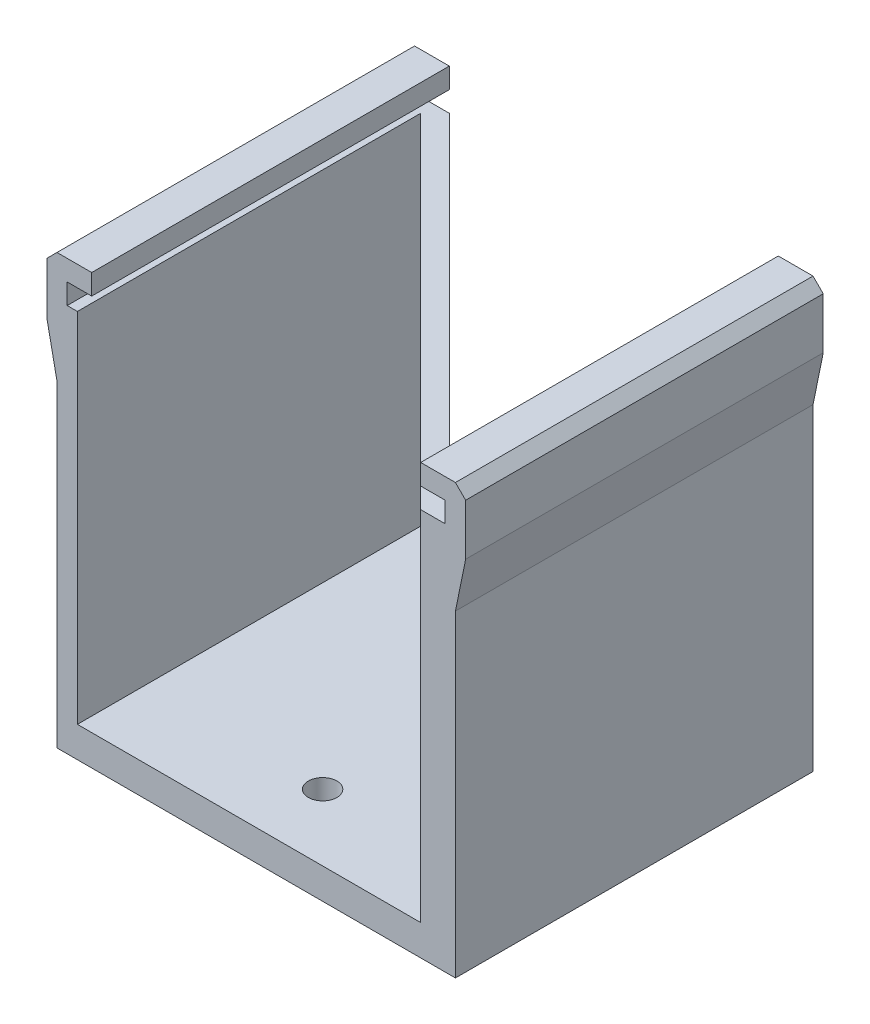
ISO-10303-21;
HEADER;
FILE_DESCRIPTION(('STEP AP214'),'2;1');
FILE_NAME('part.step','',(''),(''),'','','');
FILE_SCHEMA(('AUTOMOTIVE_DESIGN { 1 0 10303 214 1 1 1 1 }'));
ENDSEC;
DATA;
#1=APPLICATION_CONTEXT('core data for automotive mechanical design processes');
#2=APPLICATION_PROTOCOL_DEFINITION('international standard','automotive_design',2000,#1);
#3=PRODUCT_CONTEXT('',#1,'mechanical');
#4=PRODUCT('Part','Part','',(#3));
#5=PRODUCT_RELATED_PRODUCT_CATEGORY('part','',(#4));
#6=PRODUCT_DEFINITION_FORMATION('','',#4);
#7=PRODUCT_DEFINITION_CONTEXT('part definition',#1,'design');
#8=PRODUCT_DEFINITION('design','',#6,#7);
#9=PRODUCT_DEFINITION_SHAPE('','',#8);
#10=(LENGTH_UNIT() NAMED_UNIT(*) SI_UNIT(.MILLI.,.METRE.));
#11=(NAMED_UNIT(*) PLANE_ANGLE_UNIT() SI_UNIT($,.RADIAN.));
#12=(NAMED_UNIT(*) SI_UNIT($,.STERADIAN.) SOLID_ANGLE_UNIT());
#13=UNCERTAINTY_MEASURE_WITH_UNIT(LENGTH_MEASURE(1.E-05),#10,'distance_accuracy_value','');
#14=(GEOMETRIC_REPRESENTATION_CONTEXT(3) GLOBAL_UNCERTAINTY_ASSIGNED_CONTEXT((#13)) GLOBAL_UNIT_ASSIGNED_CONTEXT((#10,
#11,#12)) REPRESENTATION_CONTEXT('',''));
#15=CARTESIAN_POINT('',(0.,0.,0.));
#16=DIRECTION('',(0.,0.,1.));
#17=DIRECTION('',(1.,0.,0.));
#18=AXIS2_PLACEMENT_3D('',#15,#16,#17);
#19=CARTESIAN_POINT('',(0.,38.,0.));
#20=DIRECTION('',(0.,1.,0.));
#21=DIRECTION('',(0.,0.,1.));
#22=AXIS2_PLACEMENT_3D('',#19,#20,#21);
#23=PLANE('',#22);
#24=DIRECTION('',(1.,0.,0.));
#25=VECTOR('',#24,1.);
#26=CARTESIAN_POINT('',(-1.4,38.,0.));
#27=LINE('',#26,#25);
#28=CARTESIAN_POINT('',(-1.4,38.,0.));
#29=VERTEX_POINT('',#28);
#30=CARTESIAN_POINT('',(1.,38.,0.));
#31=VERTEX_POINT('',#30);
#32=EDGE_CURVE('E249',#29,#31,#27,.T.);
#33=ORIENTED_EDGE('',*,*,#32,.T.);
#34=DIRECTION('',(0.,0.,1.));
#35=VECTOR('',#34,1.);
#36=CARTESIAN_POINT('',(1.,38.,0.));
#37=LINE('',#36,#35);
#38=CARTESIAN_POINT('',(1.,38.,-35.));
#39=VERTEX_POINT('',#38);
#40=EDGE_CURVE('E342',#39,#31,#37,.T.);
#41=ORIENTED_EDGE('',*,*,#40,.F.);
#42=DIRECTION('',(-1.,0.,0.));
#43=VECTOR('',#42,1.);
#44=CARTESIAN_POINT('',(2.,38.,-35.));
#45=LINE('',#44,#43);
#46=CARTESIAN_POINT('',(0.,38.,-35.));
#47=VERTEX_POINT('',#46);
#48=EDGE_CURVE('E227',#39,#47,#45,.T.);
#49=ORIENTED_EDGE('',*,*,#48,.T.);
#50=DIRECTION('',(0.,0.,1.));
#51=VECTOR('',#50,1.);
#52=CARTESIAN_POINT('',(0.,38.,0.));
#53=LINE('',#52,#51);
#54=CARTESIAN_POINT('',(0.,38.,-1.42842712474617));
#55=VERTEX_POINT('',#54);
#56=EDGE_CURVE('E241',#47,#55,#53,.T.);
#57=ORIENTED_EDGE('',*,*,#56,.T.);
#58=DIRECTION('',(-0.707106781186548,0.,-0.707106781186548));
#59=VECTOR('',#58,1.);
#60=CARTESIAN_POINT('',(0.,38.,-1.42842712474617));
#61=LINE('',#60,#59);
#62=CARTESIAN_POINT('',(-33.5715728752538,38.,-35.));
#63=VERTEX_POINT('',#62);
#64=EDGE_CURVE('E254',#55,#63,#61,.T.);
#65=ORIENTED_EDGE('',*,*,#64,.T.);
#66=DIRECTION('',(-1.,0.,0.));
#67=VECTOR('',#66,1.);
#68=CARTESIAN_POINT('',(-33.5715728752538,38.,-35.));
#69=LINE('',#68,#67);
#70=CARTESIAN_POINT('',(-36.,38.,-35.));
#71=VERTEX_POINT('',#70);
#72=EDGE_CURVE('E257',#63,#71,#69,.T.);
#73=ORIENTED_EDGE('',*,*,#72,.T.);
#74=DIRECTION('',(0.,0.,-1.));
#75=VECTOR('',#74,1.);
#76=CARTESIAN_POINT('',(-36.,38.,-35.));
#77=LINE('',#76,#75);
#78=CARTESIAN_POINT('',(-36.,38.,0.));
#79=VERTEX_POINT('',#78);
#80=EDGE_CURVE('E330',#79,#71,#77,.T.);
#81=ORIENTED_EDGE('',*,*,#80,.F.);
#82=DIRECTION('',(1.,0.,0.));
#83=VECTOR('',#82,1.);
#84=CARTESIAN_POINT('',(-37.,38.,0.));
#85=LINE('',#84,#83);
#86=CARTESIAN_POINT('',(-35.,38.,0.));
#87=VERTEX_POINT('',#86);
#88=EDGE_CURVE('E242',#79,#87,#85,.T.);
#89=ORIENTED_EDGE('',*,*,#88,.T.);
#90=DIRECTION('',(0.,0.,-1.));
#91=VECTOR('',#90,1.);
#92=CARTESIAN_POINT('',(-35.,38.,-35.));
#93=LINE('',#92,#91);
#94=CARTESIAN_POINT('',(-35.,38.,-33.6));
#95=VERTEX_POINT('',#94);
#96=EDGE_CURVE('E311',#87,#95,#93,.T.);
#97=ORIENTED_EDGE('',*,*,#96,.T.);
#98=DIRECTION('',(0.707106781186547,0.,0.707106781186548));
#99=VECTOR('',#98,1.);
#100=CARTESIAN_POINT('',(-35.,38.,-33.6));
#101=LINE('',#100,#99);
#102=EDGE_CURVE('E246',#95,#29,#101,.T.);
#103=ORIENTED_EDGE('',*,*,#102,.T.);
#104=EDGE_LOOP('',(#33,#41,#49,#57,#65,#73,#81,#89,#97,#103));
#105=FACE_BOUND('',#104,.T.);
#106=ADVANCED_FACE('F39',(#105),#23,.T.);
#107=CARTESIAN_POINT('',(0.,3.,0.));
#108=DIRECTION('',(0.,1.,0.));
#109=DIRECTION('',(0.,0.,1.));
#110=AXIS2_PLACEMENT_3D('',#107,#108,#109);
#111=PLANE('',#110);
#112=CARTESIAN_POINT('',(-17.5,3.,-28.5));
#113=DIRECTION('',(0.,1.,0.));
#114=DIRECTION('',(0.,0.,1.));
#115=AXIS2_PLACEMENT_3D('',#112,#113,#114);
#116=CIRCLE('',#115,1.4);
#117=CARTESIAN_POINT('',(-17.5,3.,-27.1));
#118=VERTEX_POINT('',#117);
#119=EDGE_CURVE('E381',#118,#118,#116,.T.);
#120=ORIENTED_EDGE('',*,*,#119,.F.);
#121=EDGE_LOOP('',(#120));
#122=FACE_BOUND('',#121,.T.);
#123=DIRECTION('',(-0.707106781186548,0.,-0.707106781186548));
#124=VECTOR('',#123,1.);
#125=CARTESIAN_POINT('',(0.,3.,-1.42842712474617));
#126=LINE('',#125,#124);
#127=CARTESIAN_POINT('',(0.,3.,-1.42842712474617));
#128=VERTEX_POINT('',#127);
#129=CARTESIAN_POINT('',(-33.5715728752538,3.,-35.));
#130=VERTEX_POINT('',#129);
#131=EDGE_CURVE('E250',#128,#130,#126,.T.);
#132=ORIENTED_EDGE('',*,*,#131,.F.);
#133=DIRECTION('',(0.,0.,-1.));
#134=VECTOR('',#133,1.);
#135=CARTESIAN_POINT('',(0.,3.,0.));
#136=LINE('',#135,#134);
#137=CARTESIAN_POINT('',(0.,3.,-35.));
#138=VERTEX_POINT('',#137);
#139=EDGE_CURVE('E283',#128,#138,#136,.T.);
#140=ORIENTED_EDGE('',*,*,#139,.T.);
#141=DIRECTION('',(-1.,0.,0.));
#142=VECTOR('',#141,1.);
#143=CARTESIAN_POINT('',(0.,3.,-35.));
#144=LINE('',#143,#142);
#145=EDGE_CURVE('E287',#138,#130,#144,.T.);
#146=ORIENTED_EDGE('',*,*,#145,.T.);
#147=EDGE_LOOP('',(#132,#140,#146));
#148=FACE_BOUND('',#147,.T.);
#149=ADVANCED_FACE('F398',(#122,#148),#111,.T.);
#150=CARTESIAN_POINT('',(0.,3.,-35.));
#151=DIRECTION('',(0.,0.,1.));
#152=DIRECTION('',(1.,0.,0.));
#153=AXIS2_PLACEMENT_3D('',#150,#151,#152);
#154=PLANE('',#153);
#155=DIRECTION('',(-1.,0.,0.));
#156=VECTOR('',#155,1.);
#157=CARTESIAN_POINT('',(0.,0.,-35.));
#158=LINE('',#157,#156);
#159=CARTESIAN_POINT('',(2.,0.,-35.));
#160=VERTEX_POINT('',#159);
#161=CARTESIAN_POINT('',(-37.,0.,-35.));
#162=VERTEX_POINT('',#161);
#163=EDGE_CURVE('E282',#160,#162,#158,.T.);
#164=ORIENTED_EDGE('',*,*,#163,.T.);
#165=DIRECTION('',(0.,-1.,0.));
#166=VECTOR('',#165,1.);
#167=CARTESIAN_POINT('',(-37.,38.,-35.));
#168=LINE('',#167,#166);
#169=CARTESIAN_POINT('',(-37.,31.1010205144337,-35.));
#170=VERTEX_POINT('',#169);
#171=EDGE_CURVE('E306',#170,#162,#168,.T.);
#172=ORIENTED_EDGE('',*,*,#171,.F.);
#173=DIRECTION('',(0.2,-0.979795897113271,0.));
#174=VECTOR('',#173,1.);
#175=CARTESIAN_POINT('',(-38.,36.,-35.));
#176=LINE('',#175,#174);
#177=CARTESIAN_POINT('',(-38.,36.,-35.));
#178=VERTEX_POINT('',#177);
#179=EDGE_CURVE('E759',#178,#170,#176,.T.);
#180=ORIENTED_EDGE('',*,*,#179,.F.);
#181=DIRECTION('',(0.,-1.,0.));
#182=VECTOR('',#181,1.);
#183=CARTESIAN_POINT('',(-38.,41.,-35.));
#184=LINE('',#183,#182);
#185=CARTESIAN_POINT('',(-38.,41.,-35.));
#186=VERTEX_POINT('',#185);
#187=EDGE_CURVE('E754',#186,#178,#184,.T.);
#188=ORIENTED_EDGE('',*,*,#187,.F.);
#189=DIRECTION('',(-0.707106781186547,-0.707106781186547,0.));
#190=VECTOR('',#189,1.);
#191=CARTESIAN_POINT('',(-37.,42.,-35.));
#192=LINE('',#191,#190);
#193=CARTESIAN_POINT('',(-37.,42.,-35.));
#194=VERTEX_POINT('',#193);
#195=EDGE_CURVE('E750',#194,#186,#192,.T.);
#196=ORIENTED_EDGE('',*,*,#195,.F.);
#197=DIRECTION('',(-1.,0.,0.));
#198=VECTOR('',#197,1.);
#199=CARTESIAN_POINT('',(-37.,42.,-35.));
#200=LINE('',#199,#198);
#201=CARTESIAN_POINT('',(-33.6,42.,-35.));
#202=VERTEX_POINT('',#201);
#203=EDGE_CURVE('E819',#202,#194,#200,.T.);
#204=ORIENTED_EDGE('',*,*,#203,.F.);
#205=DIRECTION('',(0.,1.,0.));
#206=VECTOR('',#205,1.);
#207=CARTESIAN_POINT('',(-33.6,40.,-35.));
#208=LINE('',#207,#206);
#209=CARTESIAN_POINT('',(-33.6,40.,-35.));
#210=VERTEX_POINT('',#209);
#211=EDGE_CURVE('E814',#210,#202,#208,.T.);
#212=ORIENTED_EDGE('',*,*,#211,.F.);
#213=DIRECTION('',(1.,0.,0.));
#214=VECTOR('',#213,1.);
#215=CARTESIAN_POINT('',(-37.,40.,-35.));
#216=LINE('',#215,#214);
#217=CARTESIAN_POINT('',(-36.,40.,-35.));
#218=VERTEX_POINT('',#217);
#219=EDGE_CURVE('E811',#218,#210,#216,.T.);
#220=ORIENTED_EDGE('',*,*,#219,.F.);
#221=DIRECTION('',(0.,-1.,0.));
#222=VECTOR('',#221,1.);
#223=CARTESIAN_POINT('',(-36.,40.,-35.));
#224=LINE('',#223,#222);
#225=EDGE_CURVE('E367',#218,#71,#224,.T.);
#226=ORIENTED_EDGE('',*,*,#225,.T.);
#227=ORIENTED_EDGE('',*,*,#72,.F.);
#228=DIRECTION('',(0.,-1.,0.));
#229=VECTOR('',#228,1.);
#230=CARTESIAN_POINT('',(-33.5715728752538,38.,-35.));
#231=LINE('',#230,#229);
#232=EDGE_CURVE('E260',#63,#130,#231,.T.);
#233=ORIENTED_EDGE('',*,*,#232,.T.);
#234=ORIENTED_EDGE('',*,*,#145,.F.);
#235=DIRECTION('',(0.,1.,0.));
#236=VECTOR('',#235,1.);
#237=CARTESIAN_POINT('',(0.,0.,-35.));
#238=LINE('',#237,#236);
#239=EDGE_CURVE('E237',#138,#47,#238,.T.);
#240=ORIENTED_EDGE('',*,*,#239,.T.);
#241=ORIENTED_EDGE('',*,*,#48,.F.);
#242=DIRECTION('',(0.,-1.,0.));
#243=VECTOR('',#242,1.);
#244=CARTESIAN_POINT('',(1.,40.,-35.));
#245=LINE('',#244,#243);
#246=CARTESIAN_POINT('',(1.,40.,-35.));
#247=VERTEX_POINT('',#246);
#248=EDGE_CURVE('E354',#247,#39,#245,.T.);
#249=ORIENTED_EDGE('',*,*,#248,.F.);
#250=DIRECTION('',(1.,0.,0.));
#251=VECTOR('',#250,1.);
#252=CARTESIAN_POINT('',(2.,40.,-35.));
#253=LINE('',#252,#251);
#254=CARTESIAN_POINT('',(-1.4,40.,-35.));
#255=VERTEX_POINT('',#254);
#256=EDGE_CURVE('E789',#255,#247,#253,.T.);
#257=ORIENTED_EDGE('',*,*,#256,.F.);
#258=DIRECTION('',(0.,-1.,0.));
#259=VECTOR('',#258,1.);
#260=CARTESIAN_POINT('',(-1.4,40.,-35.));
#261=LINE('',#260,#259);
#262=CARTESIAN_POINT('',(-1.4,42.,-35.));
#263=VERTEX_POINT('',#262);
#264=EDGE_CURVE('E785',#263,#255,#261,.T.);
#265=ORIENTED_EDGE('',*,*,#264,.F.);
#266=DIRECTION('',(-1.,0.,0.));
#267=VECTOR('',#266,1.);
#268=CARTESIAN_POINT('',(2.,42.,-35.));
#269=LINE('',#268,#267);
#270=CARTESIAN_POINT('',(2.,42.,-35.));
#271=VERTEX_POINT('',#270);
#272=EDGE_CURVE('E781',#271,#263,#269,.T.);
#273=ORIENTED_EDGE('',*,*,#272,.F.);
#274=DIRECTION('',(-0.707106781186547,0.707106781186548,0.));
#275=VECTOR('',#274,1.);
#276=CARTESIAN_POINT('',(2.,42.,-35.));
#277=LINE('',#276,#275);
#278=CARTESIAN_POINT('',(3.,41.,-35.));
#279=VERTEX_POINT('',#278);
#280=EDGE_CURVE('E209',#279,#271,#277,.T.);
#281=ORIENTED_EDGE('',*,*,#280,.F.);
#282=DIRECTION('',(0.,1.,0.));
#283=VECTOR('',#282,1.);
#284=CARTESIAN_POINT('',(3.,41.,-35.));
#285=LINE('',#284,#283);
#286=CARTESIAN_POINT('',(3.,36.,-35.));
#287=VERTEX_POINT('',#286);
#288=EDGE_CURVE('E218',#287,#279,#285,.T.);
#289=ORIENTED_EDGE('',*,*,#288,.F.);
#290=DIRECTION('',(0.2,0.979795897113271,0.));
#291=VECTOR('',#290,1.);
#292=CARTESIAN_POINT('',(3.,36.,-35.));
#293=LINE('',#292,#291);
#294=CARTESIAN_POINT('',(2.,31.1010205144337,-35.));
#295=VERTEX_POINT('',#294);
#296=EDGE_CURVE('E203',#295,#287,#293,.T.);
#297=ORIENTED_EDGE('',*,*,#296,.F.);
#298=DIRECTION('',(0.,1.,0.));
#299=VECTOR('',#298,1.);
#300=CARTESIAN_POINT('',(2.,0.,-35.));
#301=LINE('',#300,#299);
#302=EDGE_CURVE('E215',#160,#295,#301,.T.);
#303=ORIENTED_EDGE('',*,*,#302,.F.);
#304=EDGE_LOOP('',(#164,#172,#180,#188,#196,#204,#212,#220,#226,#227,#233,#234,#240,#241,#249,
#257,#265,#273,#281,#289,#297,#303));
#305=FACE_BOUND('',#304,.T.);
#306=ADVANCED_FACE('F41',(#305),#154,.F.);
#307=CARTESIAN_POINT('',(0.,3.,0.));
#308=DIRECTION('',(0.,0.,-1.));
#309=DIRECTION('',(-1.,0.,0.));
#310=AXIS2_PLACEMENT_3D('',#307,#308,#309);
#311=PLANE('',#310);
#312=DIRECTION('',(1.,0.,0.));
#313=VECTOR('',#312,1.);
#314=CARTESIAN_POINT('',(0.,0.,0.));
#315=LINE('',#314,#313);
#316=CARTESIAN_POINT('',(-37.,0.,0.));
#317=VERTEX_POINT('',#316);
#318=CARTESIAN_POINT('',(2.,0.,0.));
#319=VERTEX_POINT('',#318);
#320=EDGE_CURVE('E43',#317,#319,#315,.T.);
#321=ORIENTED_EDGE('',*,*,#320,.T.);
#322=DIRECTION('',(0.,-1.,0.));
#323=VECTOR('',#322,1.);
#324=CARTESIAN_POINT('',(2.,0.,0.));
#325=LINE('',#324,#323);
#326=CARTESIAN_POINT('',(2.,31.1010205144337,0.));
#327=VERTEX_POINT('',#326);
#328=EDGE_CURVE('E233',#327,#319,#325,.T.);
#329=ORIENTED_EDGE('',*,*,#328,.F.);
#330=DIRECTION('',(0.2,0.979795897113271,0.));
#331=VECTOR('',#330,1.);
#332=CARTESIAN_POINT('',(3.,36.,0.));
#333=LINE('',#332,#331);
#334=CARTESIAN_POINT('',(3.,36.,0.));
#335=VERTEX_POINT('',#334);
#336=EDGE_CURVE('E57',#327,#335,#333,.T.);
#337=ORIENTED_EDGE('',*,*,#336,.T.);
#338=DIRECTION('',(0.,1.,0.));
#339=VECTOR('',#338,1.);
#340=CARTESIAN_POINT('',(3.,41.,0.));
#341=LINE('',#340,#339);
#342=CARTESIAN_POINT('',(3.,41.,0.));
#343=VERTEX_POINT('',#342);
#344=EDGE_CURVE('E732',#335,#343,#341,.T.);
#345=ORIENTED_EDGE('',*,*,#344,.T.);
#346=DIRECTION('',(-0.707106781186547,0.707106781186548,0.));
#347=VECTOR('',#346,1.);
#348=CARTESIAN_POINT('',(2.,42.,0.));
#349=LINE('',#348,#347);
#350=CARTESIAN_POINT('',(2.,42.,0.));
#351=VERTEX_POINT('',#350);
#352=EDGE_CURVE('E220',#343,#351,#349,.T.);
#353=ORIENTED_EDGE('',*,*,#352,.T.);
#354=DIRECTION('',(-1.,0.,0.));
#355=VECTOR('',#354,1.);
#356=CARTESIAN_POINT('',(2.,42.,0.));
#357=LINE('',#356,#355);
#358=CARTESIAN_POINT('',(-1.4,42.,0.));
#359=VERTEX_POINT('',#358);
#360=EDGE_CURVE('E775',#351,#359,#357,.T.);
#361=ORIENTED_EDGE('',*,*,#360,.T.);
#362=DIRECTION('',(0.,-1.,0.));
#363=VECTOR('',#362,1.);
#364=CARTESIAN_POINT('',(-1.4,40.,0.));
#365=LINE('',#364,#363);
#366=CARTESIAN_POINT('',(-1.4,40.,0.));
#367=VERTEX_POINT('',#366);
#368=EDGE_CURVE('E797',#359,#367,#365,.T.);
#369=ORIENTED_EDGE('',*,*,#368,.T.);
#370=DIRECTION('',(1.,0.,0.));
#371=VECTOR('',#370,1.);
#372=CARTESIAN_POINT('',(2.,40.,0.));
#373=LINE('',#372,#371);
#374=CARTESIAN_POINT('',(1.,40.,0.));
#375=VERTEX_POINT('',#374);
#376=EDGE_CURVE('E349',#367,#375,#373,.T.);
#377=ORIENTED_EDGE('',*,*,#376,.T.);
#378=DIRECTION('',(0.,-1.,0.));
#379=VECTOR('',#378,1.);
#380=CARTESIAN_POINT('',(1.,40.,0.));
#381=LINE('',#380,#379);
#382=EDGE_CURVE('E346',#375,#31,#381,.T.);
#383=ORIENTED_EDGE('',*,*,#382,.T.);
#384=ORIENTED_EDGE('',*,*,#32,.F.);
#385=DIRECTION('',(0.,-1.,0.));
#386=VECTOR('',#385,1.);
#387=CARTESIAN_POINT('',(-1.4,38.,0.));
#388=LINE('',#387,#386);
#389=CARTESIAN_POINT('',(-1.4,3.,0.));
#390=VERTEX_POINT('',#389);
#391=EDGE_CURVE('E274',#29,#390,#388,.T.);
#392=ORIENTED_EDGE('',*,*,#391,.T.);
#393=DIRECTION('',(1.,0.,0.));
#394=VECTOR('',#393,1.);
#395=CARTESIAN_POINT('',(0.,3.,0.));
#396=LINE('',#395,#394);
#397=CARTESIAN_POINT('',(-35.,3.,0.));
#398=VERTEX_POINT('',#397);
#399=EDGE_CURVE('E11',#398,#390,#396,.T.);
#400=ORIENTED_EDGE('',*,*,#399,.F.);
#401=DIRECTION('',(0.,1.,0.));
#402=VECTOR('',#401,1.);
#403=CARTESIAN_POINT('',(-35.,38.,0.));
#404=LINE('',#403,#402);
#405=EDGE_CURVE('E315',#398,#87,#404,.T.);
#406=ORIENTED_EDGE('',*,*,#405,.T.);
#407=ORIENTED_EDGE('',*,*,#88,.F.);
#408=DIRECTION('',(0.,-1.,0.));
#409=VECTOR('',#408,1.);
#410=CARTESIAN_POINT('',(-36.,40.,0.));
#411=LINE('',#410,#409);
#412=CARTESIAN_POINT('',(-36.,40.,0.));
#413=VERTEX_POINT('',#412);
#414=EDGE_CURVE('E373',#413,#79,#411,.T.);
#415=ORIENTED_EDGE('',*,*,#414,.F.);
#416=DIRECTION('',(1.,0.,0.));
#417=VECTOR('',#416,1.);
#418=CARTESIAN_POINT('',(-37.,40.,0.));
#419=LINE('',#418,#417);
#420=CARTESIAN_POINT('',(-33.6,40.,0.));
#421=VERTEX_POINT('',#420);
#422=EDGE_CURVE('E805',#413,#421,#419,.T.);
#423=ORIENTED_EDGE('',*,*,#422,.T.);
#424=DIRECTION('',(0.,1.,0.));
#425=VECTOR('',#424,1.);
#426=CARTESIAN_POINT('',(-33.6,40.,0.));
#427=LINE('',#426,#425);
#428=CARTESIAN_POINT('',(-33.6,42.,0.));
#429=VERTEX_POINT('',#428);
#430=EDGE_CURVE('E825',#421,#429,#427,.T.);
#431=ORIENTED_EDGE('',*,*,#430,.T.);
#432=DIRECTION('',(-1.,0.,0.));
#433=VECTOR('',#432,1.);
#434=CARTESIAN_POINT('',(-37.,42.,0.));
#435=LINE('',#434,#433);
#436=CARTESIAN_POINT('',(-37.,42.,0.));
#437=VERTEX_POINT('',#436);
#438=EDGE_CURVE('E815',#429,#437,#435,.T.);
#439=ORIENTED_EDGE('',*,*,#438,.T.);
#440=DIRECTION('',(-0.707106781186547,-0.707106781186547,0.));
#441=VECTOR('',#440,1.);
#442=CARTESIAN_POINT('',(-37.,42.,0.));
#443=LINE('',#442,#441);
#444=CARTESIAN_POINT('',(-38.,41.,0.));
#445=VERTEX_POINT('',#444);
#446=EDGE_CURVE('E747',#437,#445,#443,.T.);
#447=ORIENTED_EDGE('',*,*,#446,.T.);
#448=DIRECTION('',(0.,-1.,0.));
#449=VECTOR('',#448,1.);
#450=CARTESIAN_POINT('',(-38.,41.,0.));
#451=LINE('',#450,#449);
#452=CARTESIAN_POINT('',(-38.,36.,0.));
#453=VERTEX_POINT('',#452);
#454=EDGE_CURVE('E767',#445,#453,#451,.T.);
#455=ORIENTED_EDGE('',*,*,#454,.T.);
#456=DIRECTION('',(0.2,-0.979795897113271,0.));
#457=VECTOR('',#456,1.);
#458=CARTESIAN_POINT('',(-38.,36.,0.));
#459=LINE('',#458,#457);
#460=CARTESIAN_POINT('',(-37.,31.1010205144337,0.));
#461=VERTEX_POINT('',#460);
#462=EDGE_CURVE('E755',#453,#461,#459,.T.);
#463=ORIENTED_EDGE('',*,*,#462,.T.);
#464=DIRECTION('',(0.,1.,0.));
#465=VECTOR('',#464,1.);
#466=CARTESIAN_POINT('',(-37.,38.,0.));
#467=LINE('',#466,#465);
#468=EDGE_CURVE('E300',#317,#461,#467,.T.);
#469=ORIENTED_EDGE('',*,*,#468,.F.);
#470=EDGE_LOOP('',(#321,#329,#337,#345,#353,#361,#369,#377,#383,#384,#392,#400,#406,#407,#415,
#423,#431,#439,#447,#455,#463,#469));
#471=FACE_BOUND('',#470,.T.);
#472=ADVANCED_FACE('F298',(#471),#311,.F.);
#473=CARTESIAN_POINT('',(-17.5,3.,-6.5));
#474=DIRECTION('',(0.,1.,0.));
#475=DIRECTION('',(0.,0.,1.));
#476=AXIS2_PLACEMENT_3D('',#473,#474,#475);
#477=CIRCLE('',#476,1.4);
#478=CARTESIAN_POINT('',(-17.5,3.,-5.1));
#479=VERTEX_POINT('',#478);
#480=EDGE_CURVE('E319',#479,#479,#477,.T.);
#481=ORIENTED_EDGE('',*,*,#480,.F.);
#482=EDGE_LOOP('',(#481));
#483=FACE_BOUND('',#482,.T.);
#484=DIRECTION('',(0.707106781186547,0.,0.707106781186548));
#485=VECTOR('',#484,1.);
#486=CARTESIAN_POINT('',(-35.,3.,-33.6));
#487=LINE('',#486,#485);
#488=CARTESIAN_POINT('',(-35.,3.,-33.6));
#489=VERTEX_POINT('',#488);
#490=EDGE_CURVE('E231',#489,#390,#487,.T.);
#491=ORIENTED_EDGE('',*,*,#490,.F.);
#492=DIRECTION('',(0.,0.,1.));
#493=VECTOR('',#492,1.);
#494=CARTESIAN_POINT('',(-35.,3.,0.));
#495=LINE('',#494,#493);
#496=EDGE_CURVE('E49',#489,#398,#495,.T.);
#497=ORIENTED_EDGE('',*,*,#496,.T.);
#498=ORIENTED_EDGE('',*,*,#399,.T.);
#499=EDGE_LOOP('',(#491,#497,#498));
#500=FACE_BOUND('',#499,.T.);
#501=ADVANCED_FACE('F394',(#483,#500),#111,.T.);
#502=CARTESIAN_POINT('',(0.,0.,0.));
#503=DIRECTION('',(0.,1.,0.));
#504=DIRECTION('',(0.,0.,1.));
#505=AXIS2_PLACEMENT_3D('',#502,#503,#504);
#506=PLANE('',#505);
#507=CARTESIAN_POINT('',(-17.5,0.,-6.5));
#508=DIRECTION('',(0.,-1.,0.));
#509=DIRECTION('',(0.,0.,-1.));
#510=AXIS2_PLACEMENT_3D('',#507,#508,#509);
#511=CIRCLE('',#510,1.4);
#512=CARTESIAN_POINT('',(-17.5,0.,-7.9));
#513=VERTEX_POINT('',#512);
#514=EDGE_CURVE('E377',#513,#513,#511,.T.);
#515=ORIENTED_EDGE('',*,*,#514,.F.);
#516=EDGE_LOOP('',(#515));
#517=FACE_BOUND('',#516,.T.);
#518=CARTESIAN_POINT('',(-17.5,0.,-28.5));
#519=DIRECTION('',(0.,-1.,0.));
#520=DIRECTION('',(0.,0.,-1.));
#521=AXIS2_PLACEMENT_3D('',#518,#519,#520);
#522=CIRCLE('',#521,1.4);
#523=CARTESIAN_POINT('',(-17.5,0.,-29.9));
#524=VERTEX_POINT('',#523);
#525=EDGE_CURVE('E376',#524,#524,#522,.T.);
#526=ORIENTED_EDGE('',*,*,#525,.F.);
#527=EDGE_LOOP('',(#526));
#528=FACE_BOUND('',#527,.T.);
#529=ORIENTED_EDGE('',*,*,#163,.F.);
#530=DIRECTION('',(0.,0.,-1.));
#531=VECTOR('',#530,1.);
#532=CARTESIAN_POINT('',(2.,0.,0.));
#533=LINE('',#532,#531);
#534=EDGE_CURVE('E225',#319,#160,#533,.T.);
#535=ORIENTED_EDGE('',*,*,#534,.F.);
#536=ORIENTED_EDGE('',*,*,#320,.F.);
#537=DIRECTION('',(0.,0.,1.));
#538=VECTOR('',#537,1.);
#539=CARTESIAN_POINT('',(-37.,0.,-35.));
#540=LINE('',#539,#538);
#541=EDGE_CURVE('E304',#162,#317,#540,.T.);
#542=ORIENTED_EDGE('',*,*,#541,.F.);
#543=EDGE_LOOP('',(#529,#535,#536,#542));
#544=FACE_BOUND('',#543,.T.);
#545=ADVANCED_FACE('F303',(#517,#528,#544),#506,.F.);
#546=CARTESIAN_POINT('',(-35.,38.,-33.6));
#547=DIRECTION('',(0.707106781186548,0.,-0.707106781186547));
#548=DIRECTION('',(-0.707106781186547,0.,-0.707106781186548));
#549=AXIS2_PLACEMENT_3D('',#546,#547,#548);
#550=PLANE('',#549);
#551=ORIENTED_EDGE('',*,*,#490,.T.);
#552=ORIENTED_EDGE('',*,*,#391,.F.);
#553=ORIENTED_EDGE('',*,*,#102,.F.);
#554=DIRECTION('',(0.,-1.,0.));
#555=VECTOR('',#554,1.);
#556=CARTESIAN_POINT('',(-35.,38.,-33.6));
#557=LINE('',#556,#555);
#558=EDGE_CURVE('E278',#95,#489,#557,.T.);
#559=ORIENTED_EDGE('',*,*,#558,.T.);
#560=EDGE_LOOP('',(#551,#552,#553,#559));
#561=FACE_BOUND('',#560,.T.);
#562=ADVANCED_FACE('F338',(#561),#550,.F.);
#563=CARTESIAN_POINT('',(0.,38.,-1.42842712474617));
#564=DIRECTION('',(-0.707106781186548,0.,0.707106781186548));
#565=DIRECTION('',(0.707106781186548,0.,0.707106781186548));
#566=AXIS2_PLACEMENT_3D('',#563,#564,#565);
#567=PLANE('',#566);
#568=ORIENTED_EDGE('',*,*,#131,.T.);
#569=ORIENTED_EDGE('',*,*,#232,.F.);
#570=ORIENTED_EDGE('',*,*,#64,.F.);
#571=DIRECTION('',(0.,-1.,0.));
#572=VECTOR('',#571,1.);
#573=CARTESIAN_POINT('',(0.,38.,-1.42842712474617));
#574=LINE('',#573,#572);
#575=EDGE_CURVE('E270',#55,#128,#574,.T.);
#576=ORIENTED_EDGE('',*,*,#575,.T.);
#577=EDGE_LOOP('',(#568,#569,#570,#576));
#578=FACE_BOUND('',#577,.T.);
#579=ADVANCED_FACE('F416',(#578),#567,.F.);
#580=CARTESIAN_POINT('',(0.,0.,0.));
#581=DIRECTION('',(-1.,0.,0.));
#582=DIRECTION('',(0.,0.,1.));
#583=AXIS2_PLACEMENT_3D('',#580,#581,#582);
#584=PLANE('',#583);
#585=ORIENTED_EDGE('',*,*,#139,.F.);
#586=ORIENTED_EDGE('',*,*,#575,.F.);
#587=ORIENTED_EDGE('',*,*,#56,.F.);
#588=ORIENTED_EDGE('',*,*,#239,.F.);
#589=EDGE_LOOP('',(#585,#586,#587,#588));
#590=FACE_BOUND('',#589,.T.);
#591=ADVANCED_FACE('F414',(#590),#584,.T.);
#592=CARTESIAN_POINT('',(2.,0.,0.));
#593=DIRECTION('',(-1.,0.,0.));
#594=DIRECTION('',(0.,0.,1.));
#595=AXIS2_PLACEMENT_3D('',#592,#593,#594);
#596=PLANE('',#595);
#597=ORIENTED_EDGE('',*,*,#302,.T.);
#598=DIRECTION('',(0.,0.,1.));
#599=VECTOR('',#598,1.);
#600=CARTESIAN_POINT('',(2.,31.1010205144337,-35.));
#601=LINE('',#600,#599);
#602=EDGE_CURVE('E200',#295,#327,#601,.T.);
#603=ORIENTED_EDGE('',*,*,#602,.T.);
#604=ORIENTED_EDGE('',*,*,#328,.T.);
#605=ORIENTED_EDGE('',*,*,#534,.T.);
#606=EDGE_LOOP('',(#597,#603,#604,#605));
#607=FACE_BOUND('',#606,.T.);
#608=ADVANCED_FACE('F223',(#607),#596,.F.);
#609=CARTESIAN_POINT('',(-37.,0.,0.));
#610=DIRECTION('',(-1.,0.,0.));
#611=DIRECTION('',(0.,0.,1.));
#612=AXIS2_PLACEMENT_3D('',#609,#610,#611);
#613=PLANE('',#612);
#614=DIRECTION('',(0.,0.,1.));
#615=VECTOR('',#614,1.);
#616=CARTESIAN_POINT('',(-37.,31.1010205144337,-35.));
#617=LINE('',#616,#615);
#618=EDGE_CURVE('E65',#170,#461,#617,.T.);
#619=ORIENTED_EDGE('',*,*,#618,.F.);
#620=ORIENTED_EDGE('',*,*,#171,.T.);
#621=ORIENTED_EDGE('',*,*,#541,.T.);
#622=ORIENTED_EDGE('',*,*,#468,.T.);
#623=EDGE_LOOP('',(#619,#620,#621,#622));
#624=FACE_BOUND('',#623,.T.);
#625=ADVANCED_FACE('F441',(#624),#613,.T.);
#626=CARTESIAN_POINT('',(-35.,0.,0.));
#627=DIRECTION('',(-1.,0.,0.));
#628=DIRECTION('',(0.,0.,1.));
#629=AXIS2_PLACEMENT_3D('',#626,#627,#628);
#630=PLANE('',#629);
#631=ORIENTED_EDGE('',*,*,#496,.F.);
#632=ORIENTED_EDGE('',*,*,#558,.F.);
#633=ORIENTED_EDGE('',*,*,#96,.F.);
#634=ORIENTED_EDGE('',*,*,#405,.F.);
#635=EDGE_LOOP('',(#631,#632,#633,#634));
#636=FACE_BOUND('',#635,.T.);
#637=ADVANCED_FACE('F335',(#636),#630,.F.);
#638=CARTESIAN_POINT('',(-17.5,10.,-28.5));
#639=DIRECTION('',(0.,-1.,0.));
#640=DIRECTION('',(0.,0.,-1.));
#641=AXIS2_PLACEMENT_3D('',#638,#639,#640);
#642=CYLINDRICAL_SURFACE('',#641,1.4);
#643=ORIENTED_EDGE('',*,*,#119,.T.);
#644=EDGE_LOOP('',(#643));
#645=FACE_BOUND('',#644,.T.);
#646=ORIENTED_EDGE('',*,*,#525,.T.);
#647=EDGE_LOOP('',(#646));
#648=FACE_BOUND('',#647,.T.);
#649=ADVANCED_FACE('F454',(#645,#648),#642,.F.);
#650=CARTESIAN_POINT('',(-17.5,10.,-6.5));
#651=DIRECTION('',(0.,-1.,0.));
#652=DIRECTION('',(0.,0.,-1.));
#653=AXIS2_PLACEMENT_3D('',#650,#651,#652);
#654=CYLINDRICAL_SURFACE('',#653,1.4);
#655=ORIENTED_EDGE('',*,*,#480,.T.);
#656=EDGE_LOOP('',(#655));
#657=FACE_BOUND('',#656,.T.);
#658=ORIENTED_EDGE('',*,*,#514,.T.);
#659=EDGE_LOOP('',(#658));
#660=FACE_BOUND('',#659,.T.);
#661=ADVANCED_FACE('F391',(#657,#660),#654,.F.);
#662=CARTESIAN_POINT('',(-36.,40.,-35.));
#663=DIRECTION('',(-1.,0.,0.));
#664=DIRECTION('',(0.,0.,1.));
#665=AXIS2_PLACEMENT_3D('',#662,#663,#664);
#666=PLANE('',#665);
#667=ORIENTED_EDGE('',*,*,#80,.T.);
#668=ORIENTED_EDGE('',*,*,#225,.F.);
#669=DIRECTION('',(0.,0.,-1.));
#670=VECTOR('',#669,1.);
#671=CARTESIAN_POINT('',(-36.,40.,-35.));
#672=LINE('',#671,#670);
#673=EDGE_CURVE('E363',#413,#218,#672,.T.);
#674=ORIENTED_EDGE('',*,*,#673,.F.);
#675=ORIENTED_EDGE('',*,*,#414,.T.);
#676=EDGE_LOOP('',(#667,#668,#674,#675));
#677=FACE_BOUND('',#676,.T.);
#678=ADVANCED_FACE('F469',(#677),#666,.F.);
#679=CARTESIAN_POINT('',(1.,40.,0.));
#680=DIRECTION('',(1.,0.,0.));
#681=DIRECTION('',(0.,0.,-1.));
#682=AXIS2_PLACEMENT_3D('',#679,#680,#681);
#683=PLANE('',#682);
#684=ORIENTED_EDGE('',*,*,#40,.T.);
#685=ORIENTED_EDGE('',*,*,#382,.F.);
#686=DIRECTION('',(0.,0.,1.));
#687=VECTOR('',#686,1.);
#688=CARTESIAN_POINT('',(1.,40.,0.));
#689=LINE('',#688,#687);
#690=EDGE_CURVE('E355',#247,#375,#689,.T.);
#691=ORIENTED_EDGE('',*,*,#690,.F.);
#692=ORIENTED_EDGE('',*,*,#248,.T.);
#693=EDGE_LOOP('',(#684,#685,#691,#692));
#694=FACE_BOUND('',#693,.T.);
#695=ADVANCED_FACE('F476',(#694),#683,.F.);
#696=CARTESIAN_POINT('',(-37.,40.,-35.));
#697=DIRECTION('',(0.,-1.,0.));
#698=DIRECTION('',(0.,0.,-1.));
#699=AXIS2_PLACEMENT_3D('',#696,#697,#698);
#700=PLANE('',#699);
#701=ORIENTED_EDGE('',*,*,#673,.T.);
#702=ORIENTED_EDGE('',*,*,#219,.T.);
#703=DIRECTION('',(0.,0.,1.));
#704=VECTOR('',#703,1.);
#705=CARTESIAN_POINT('',(-33.6,40.,-35.));
#706=LINE('',#705,#704);
#707=EDGE_CURVE('E822',#210,#421,#706,.T.);
#708=ORIENTED_EDGE('',*,*,#707,.T.);
#709=ORIENTED_EDGE('',*,*,#422,.F.);
#710=EDGE_LOOP('',(#701,#702,#708,#709));
#711=FACE_BOUND('',#710,.T.);
#712=ADVANCED_FACE('F484',(#711),#700,.T.);
#713=CARTESIAN_POINT('',(-37.,42.,-35.));
#714=DIRECTION('',(0.,1.,0.));
#715=DIRECTION('',(0.,0.,1.));
#716=AXIS2_PLACEMENT_3D('',#713,#714,#715);
#717=PLANE('',#716);
#718=ORIENTED_EDGE('',*,*,#438,.F.);
#719=DIRECTION('',(0.,0.,1.));
#720=VECTOR('',#719,1.);
#721=CARTESIAN_POINT('',(-33.6,42.,-35.));
#722=LINE('',#721,#720);
#723=EDGE_CURVE('E835',#202,#429,#722,.T.);
#724=ORIENTED_EDGE('',*,*,#723,.F.);
#725=ORIENTED_EDGE('',*,*,#203,.T.);
#726=DIRECTION('',(0.,0.,1.));
#727=VECTOR('',#726,1.);
#728=CARTESIAN_POINT('',(-37.,42.,-35.));
#729=LINE('',#728,#727);
#730=EDGE_CURVE('E832',#194,#437,#729,.T.);
#731=ORIENTED_EDGE('',*,*,#730,.T.);
#732=EDGE_LOOP('',(#718,#724,#725,#731));
#733=FACE_BOUND('',#732,.T.);
#734=ADVANCED_FACE('F491',(#733),#717,.T.);
#735=CARTESIAN_POINT('',(-33.6,40.,-35.));
#736=DIRECTION('',(1.,0.,0.));
#737=DIRECTION('',(0.,0.,-1.));
#738=AXIS2_PLACEMENT_3D('',#735,#736,#737);
#739=PLANE('',#738);
#740=ORIENTED_EDGE('',*,*,#430,.F.);
#741=ORIENTED_EDGE('',*,*,#707,.F.);
#742=ORIENTED_EDGE('',*,*,#211,.T.);
#743=ORIENTED_EDGE('',*,*,#723,.T.);
#744=EDGE_LOOP('',(#740,#741,#742,#743));
#745=FACE_BOUND('',#744,.T.);
#746=ADVANCED_FACE('F499',(#745),#739,.T.);
#747=CARTESIAN_POINT('',(2.,40.,-35.));
#748=DIRECTION('',(0.,-1.,0.));
#749=DIRECTION('',(0.,0.,-1.));
#750=AXIS2_PLACEMENT_3D('',#747,#748,#749);
#751=PLANE('',#750);
#752=ORIENTED_EDGE('',*,*,#690,.T.);
#753=ORIENTED_EDGE('',*,*,#376,.F.);
#754=DIRECTION('',(0.,0.,1.));
#755=VECTOR('',#754,1.);
#756=CARTESIAN_POINT('',(-1.4,40.,-35.));
#757=LINE('',#756,#755);
#758=EDGE_CURVE('E802',#255,#367,#757,.T.);
#759=ORIENTED_EDGE('',*,*,#758,.F.);
#760=ORIENTED_EDGE('',*,*,#256,.T.);
#761=EDGE_LOOP('',(#752,#753,#759,#760));
#762=FACE_BOUND('',#761,.T.);
#763=ADVANCED_FACE('F507',(#762),#751,.T.);
#764=CARTESIAN_POINT('',(-1.4,40.,-35.));
#765=DIRECTION('',(-1.,0.,0.));
#766=DIRECTION('',(0.,0.,1.));
#767=AXIS2_PLACEMENT_3D('',#764,#765,#766);
#768=PLANE('',#767);
#769=ORIENTED_EDGE('',*,*,#368,.F.);
#770=DIRECTION('',(0.,0.,1.));
#771=VECTOR('',#770,1.);
#772=CARTESIAN_POINT('',(-1.4,42.,-35.));
#773=LINE('',#772,#771);
#774=EDGE_CURVE('E806',#263,#359,#773,.T.);
#775=ORIENTED_EDGE('',*,*,#774,.F.);
#776=ORIENTED_EDGE('',*,*,#264,.T.);
#777=ORIENTED_EDGE('',*,*,#758,.T.);
#778=EDGE_LOOP('',(#769,#775,#776,#777));
#779=FACE_BOUND('',#778,.T.);
#780=ADVANCED_FACE('F515',(#779),#768,.T.);
#781=CARTESIAN_POINT('',(2.,42.,-35.));
#782=DIRECTION('',(0.,1.,0.));
#783=DIRECTION('',(0.,0.,1.));
#784=AXIS2_PLACEMENT_3D('',#781,#782,#783);
#785=PLANE('',#784);
#786=ORIENTED_EDGE('',*,*,#360,.F.);
#787=DIRECTION('',(0.,0.,1.));
#788=VECTOR('',#787,1.);
#789=CARTESIAN_POINT('',(2.,42.,-35.));
#790=LINE('',#789,#788);
#791=EDGE_CURVE('E793',#271,#351,#790,.T.);
#792=ORIENTED_EDGE('',*,*,#791,.F.);
#793=ORIENTED_EDGE('',*,*,#272,.T.);
#794=ORIENTED_EDGE('',*,*,#774,.T.);
#795=EDGE_LOOP('',(#786,#792,#793,#794));
#796=FACE_BOUND('',#795,.T.);
#797=ADVANCED_FACE('F523',(#796),#785,.T.);
#798=CARTESIAN_POINT('',(-38.,36.,-35.));
#799=DIRECTION('',(-0.979795897113271,-0.2,0.));
#800=DIRECTION('',(0.2,-0.979795897113271,0.));
#801=AXIS2_PLACEMENT_3D('',#798,#799,#800);
#802=PLANE('',#801);
#803=ORIENTED_EDGE('',*,*,#462,.F.);
#804=DIRECTION('',(0.,0.,1.));
#805=VECTOR('',#804,1.);
#806=CARTESIAN_POINT('',(-38.,36.,-35.));
#807=LINE('',#806,#805);
#808=EDGE_CURVE('E776',#178,#453,#807,.T.);
#809=ORIENTED_EDGE('',*,*,#808,.F.);
#810=ORIENTED_EDGE('',*,*,#179,.T.);
#811=ORIENTED_EDGE('',*,*,#618,.T.);
#812=EDGE_LOOP('',(#803,#809,#810,#811));
#813=FACE_BOUND('',#812,.T.);
#814=ADVANCED_FACE('F531',(#813),#802,.T.);
#815=CARTESIAN_POINT('',(-38.,41.,-35.));
#816=DIRECTION('',(-1.,0.,0.));
#817=DIRECTION('',(0.,0.,1.));
#818=AXIS2_PLACEMENT_3D('',#815,#816,#817);
#819=PLANE('',#818);
#820=ORIENTED_EDGE('',*,*,#454,.F.);
#821=DIRECTION('',(0.,0.,1.));
#822=VECTOR('',#821,1.);
#823=CARTESIAN_POINT('',(-38.,41.,-35.));
#824=LINE('',#823,#822);
#825=EDGE_CURVE('E763',#186,#445,#824,.T.);
#826=ORIENTED_EDGE('',*,*,#825,.F.);
#827=ORIENTED_EDGE('',*,*,#187,.T.);
#828=ORIENTED_EDGE('',*,*,#808,.T.);
#829=EDGE_LOOP('',(#820,#826,#827,#828));
#830=FACE_BOUND('',#829,.T.);
#831=ADVANCED_FACE('F539',(#830),#819,.T.);
#832=CARTESIAN_POINT('',(-37.,42.,-35.));
#833=DIRECTION('',(-0.707106781186548,0.707106781186548,0.));
#834=DIRECTION('',(-0.707106781186548,-0.707106781186548,0.));
#835=AXIS2_PLACEMENT_3D('',#832,#833,#834);
#836=PLANE('',#835);
#837=ORIENTED_EDGE('',*,*,#446,.F.);
#838=ORIENTED_EDGE('',*,*,#730,.F.);
#839=ORIENTED_EDGE('',*,*,#195,.T.);
#840=ORIENTED_EDGE('',*,*,#825,.T.);
#841=EDGE_LOOP('',(#837,#838,#839,#840));
#842=FACE_BOUND('',#841,.T.);
#843=ADVANCED_FACE('F547',(#842),#836,.T.);
#844=CARTESIAN_POINT('',(2.,42.,-35.));
#845=DIRECTION('',(0.707106781186548,0.707106781186547,0.));
#846=DIRECTION('',(-0.707106781186547,0.707106781186548,0.));
#847=AXIS2_PLACEMENT_3D('',#844,#845,#846);
#848=PLANE('',#847);
#849=ORIENTED_EDGE('',*,*,#352,.F.);
#850=DIRECTION('',(0.,0.,1.));
#851=VECTOR('',#850,1.);
#852=CARTESIAN_POINT('',(3.,41.,-35.));
#853=LINE('',#852,#851);
#854=EDGE_CURVE('E733',#279,#343,#853,.T.);
#855=ORIENTED_EDGE('',*,*,#854,.F.);
#856=ORIENTED_EDGE('',*,*,#280,.T.);
#857=ORIENTED_EDGE('',*,*,#791,.T.);
#858=EDGE_LOOP('',(#849,#855,#856,#857));
#859=FACE_BOUND('',#858,.T.);
#860=ADVANCED_FACE('F555',(#859),#848,.T.);
#861=CARTESIAN_POINT('',(3.,41.,-35.));
#862=DIRECTION('',(1.,0.,0.));
#863=DIRECTION('',(0.,1.,0.));
#864=AXIS2_PLACEMENT_3D('',#861,#862,#863);
#865=PLANE('',#864);
#866=ORIENTED_EDGE('',*,*,#344,.F.);
#867=DIRECTION('',(0.,0.,1.));
#868=VECTOR('',#867,1.);
#869=CARTESIAN_POINT('',(3.,36.,-35.));
#870=LINE('',#869,#868);
#871=EDGE_CURVE('E208',#287,#335,#870,.T.);
#872=ORIENTED_EDGE('',*,*,#871,.F.);
#873=ORIENTED_EDGE('',*,*,#288,.T.);
#874=ORIENTED_EDGE('',*,*,#854,.T.);
#875=EDGE_LOOP('',(#866,#872,#873,#874));
#876=FACE_BOUND('',#875,.T.);
#877=ADVANCED_FACE('F563',(#876),#865,.T.);
#878=CARTESIAN_POINT('',(3.,36.,-35.));
#879=DIRECTION('',(0.979795897113271,-0.2,0.));
#880=DIRECTION('',(0.2,0.979795897113271,0.));
#881=AXIS2_PLACEMENT_3D('',#878,#879,#880);
#882=PLANE('',#881);
#883=ORIENTED_EDGE('',*,*,#336,.F.);
#884=ORIENTED_EDGE('',*,*,#602,.F.);
#885=ORIENTED_EDGE('',*,*,#296,.T.);
#886=ORIENTED_EDGE('',*,*,#871,.T.);
#887=EDGE_LOOP('',(#883,#884,#885,#886));
#888=FACE_BOUND('',#887,.T.);
#889=ADVANCED_FACE('F202',(#888),#882,.T.);
#890=CLOSED_SHELL('',(#106,#149,#306,#472,#501,#545,#562,#579,#591,#608,#625,#637,#649,#661,
#678,#695,#712,#734,#746,#763,#780,#797,#814,#831,#843,#860,#877,#889));
#891=MANIFOLD_SOLID_BREP('B2',#890);
#892=ADVANCED_BREP_SHAPE_REPRESENTATION('',(#18,#891),#14);
#893=SHAPE_DEFINITION_REPRESENTATION(#9,#892);
ENDSEC;
END-ISO-10303-21;
